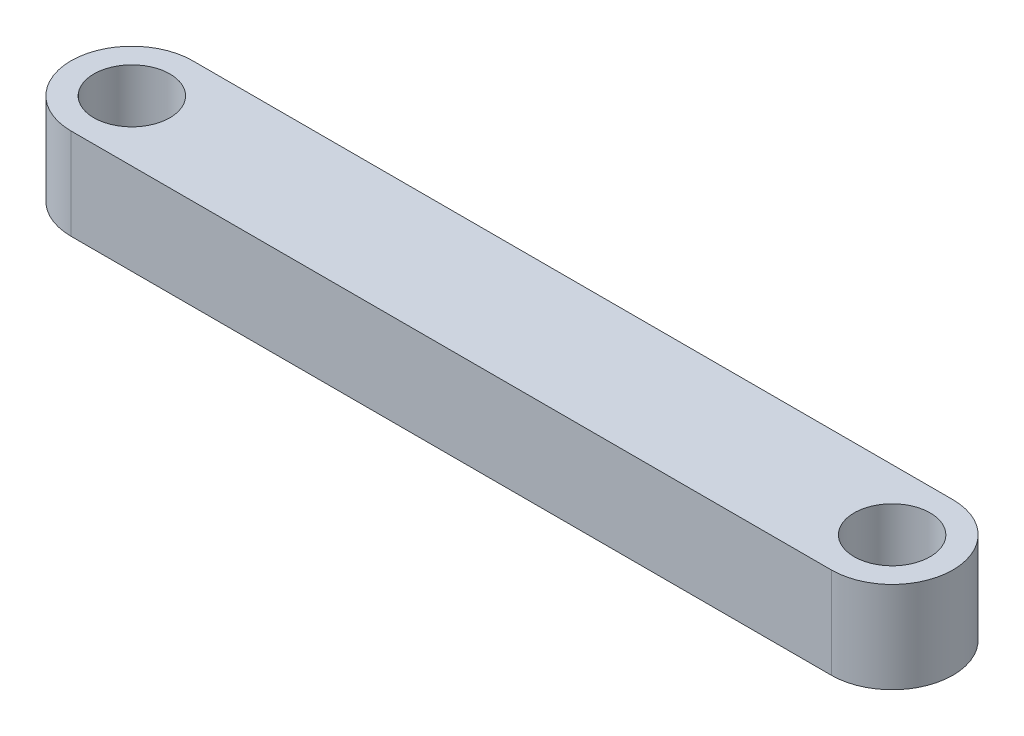
ISO-10303-21;
HEADER;
FILE_DESCRIPTION(('STEP AP214'),'2;1');
FILE_NAME('part.step','',(''),(''),'','','');
FILE_SCHEMA(('AUTOMOTIVE_DESIGN { 1 0 10303 214 1 1 1 1 }'));
ENDSEC;
DATA;
#1=APPLICATION_CONTEXT('core data for automotive mechanical design processes');
#2=APPLICATION_PROTOCOL_DEFINITION('international standard','automotive_design',2000,#1);
#3=PRODUCT_CONTEXT('',#1,'mechanical');
#4=PRODUCT('Part','Part','',(#3));
#5=PRODUCT_RELATED_PRODUCT_CATEGORY('part','',(#4));
#6=PRODUCT_DEFINITION_FORMATION('','',#4);
#7=PRODUCT_DEFINITION_CONTEXT('part definition',#1,'design');
#8=PRODUCT_DEFINITION('design','',#6,#7);
#9=PRODUCT_DEFINITION_SHAPE('','',#8);
#10=(LENGTH_UNIT() NAMED_UNIT(*) SI_UNIT(.MILLI.,.METRE.));
#11=(NAMED_UNIT(*) PLANE_ANGLE_UNIT() SI_UNIT($,.RADIAN.));
#12=(NAMED_UNIT(*) SI_UNIT($,.STERADIAN.) SOLID_ANGLE_UNIT());
#13=UNCERTAINTY_MEASURE_WITH_UNIT(LENGTH_MEASURE(1.E-05),#10,'distance_accuracy_value','');
#14=(GEOMETRIC_REPRESENTATION_CONTEXT(3) GLOBAL_UNCERTAINTY_ASSIGNED_CONTEXT((#13)) GLOBAL_UNIT_ASSIGNED_CONTEXT((#10,
#11,#12)) REPRESENTATION_CONTEXT('',''));
#15=CARTESIAN_POINT('',(0.,0.,0.));
#16=DIRECTION('',(0.,0.,1.));
#17=DIRECTION('',(1.,0.,0.));
#18=AXIS2_PLACEMENT_3D('',#15,#16,#17);
#19=CARTESIAN_POINT('',(0.,7.62,0.));
#20=DIRECTION('',(0.,1.,0.));
#21=DIRECTION('',(0.,0.,1.));
#22=AXIS2_PLACEMENT_3D('',#19,#20,#21);
#23=PLANE('',#22);
#24=CARTESIAN_POINT('',(0.,7.62,0.));
#25=DIRECTION('',(0.,1.,0.));
#26=DIRECTION('',(0.,0.,1.));
#27=AXIS2_PLACEMENT_3D('',#24,#25,#26);
#28=CIRCLE('',#27,3.175);
#29=CARTESIAN_POINT('',(0.,7.62,3.175));
#30=VERTEX_POINT('',#29);
#31=EDGE_CURVE('E99',#30,#30,#28,.T.);
#32=ORIENTED_EDGE('',*,*,#31,.F.);
#33=EDGE_LOOP('',(#32));
#34=FACE_BOUND('',#33,.T.);
#35=CARTESIAN_POINT('',(0.,7.62,0.));
#36=DIRECTION('',(0.,1.,0.));
#37=DIRECTION('',(0.,0.,1.));
#38=AXIS2_PLACEMENT_3D('',#35,#36,#37);
#39=CIRCLE('',#38,5.08);
#40=CARTESIAN_POINT('',(0.,7.62,-5.08));
#41=VERTEX_POINT('',#40);
#42=CARTESIAN_POINT('',(0.,7.62,5.08));
#43=VERTEX_POINT('',#42);
#44=EDGE_CURVE('E84',#41,#43,#39,.T.);
#45=ORIENTED_EDGE('',*,*,#44,.T.);
#46=DIRECTION('',(1.,0.,0.));
#47=VECTOR('',#46,1.);
#48=CARTESIAN_POINT('',(0.,7.62,5.08));
#49=LINE('',#48,#47);
#50=CARTESIAN_POINT('',(63.5,7.62,5.08));
#51=VERTEX_POINT('',#50);
#52=EDGE_CURVE('E79',#43,#51,#49,.T.);
#53=ORIENTED_EDGE('',*,*,#52,.T.);
#54=CARTESIAN_POINT('',(63.5,7.62,0.));
#55=DIRECTION('',(0.,1.,0.));
#56=DIRECTION('',(0.,0.,1.));
#57=AXIS2_PLACEMENT_3D('',#54,#55,#56);
#58=CIRCLE('',#57,5.08);
#59=CARTESIAN_POINT('',(63.5,7.62,-5.08));
#60=VERTEX_POINT('',#59);
#61=EDGE_CURVE('E82',#51,#60,#58,.T.);
#62=ORIENTED_EDGE('',*,*,#61,.T.);
#63=DIRECTION('',(-1.,0.,0.));
#64=VECTOR('',#63,1.);
#65=CARTESIAN_POINT('',(0.,7.62,-5.08));
#66=LINE('',#65,#64);
#67=EDGE_CURVE('E49',#60,#41,#66,.T.);
#68=ORIENTED_EDGE('',*,*,#67,.T.);
#69=EDGE_LOOP('',(#45,#53,#62,#68));
#70=FACE_BOUND('',#69,.T.);
#71=CARTESIAN_POINT('',(63.5,7.62,0.));
#72=DIRECTION('',(0.,1.,0.));
#73=DIRECTION('',(0.,0.,1.));
#74=AXIS2_PLACEMENT_3D('',#71,#72,#73);
#75=CIRCLE('',#74,3.175);
#76=CARTESIAN_POINT('',(63.5,7.62,3.175));
#77=VERTEX_POINT('',#76);
#78=EDGE_CURVE('E114',#77,#77,#75,.T.);
#79=ORIENTED_EDGE('',*,*,#78,.F.);
#80=EDGE_LOOP('',(#79));
#81=FACE_BOUND('',#80,.T.);
#82=ADVANCED_FACE('F32',(#34,#70,#81),#23,.T.);
#83=CARTESIAN_POINT('',(0.,0.,0.));
#84=DIRECTION('',(0.,1.,0.));
#85=DIRECTION('',(0.,0.,1.));
#86=AXIS2_PLACEMENT_3D('',#83,#84,#85);
#87=PLANE('',#86);
#88=CARTESIAN_POINT('',(0.,0.,0.));
#89=DIRECTION('',(0.,1.,0.));
#90=DIRECTION('',(0.,0.,1.));
#91=AXIS2_PLACEMENT_3D('',#88,#89,#90);
#92=CIRCLE('',#91,3.175);
#93=CARTESIAN_POINT('',(0.,0.,3.175));
#94=VERTEX_POINT('',#93);
#95=EDGE_CURVE('E111',#94,#94,#92,.T.);
#96=ORIENTED_EDGE('',*,*,#95,.T.);
#97=EDGE_LOOP('',(#96));
#98=FACE_BOUND('',#97,.T.);
#99=CARTESIAN_POINT('',(0.,0.,0.));
#100=DIRECTION('',(0.,1.,0.));
#101=DIRECTION('',(0.,0.,1.));
#102=AXIS2_PLACEMENT_3D('',#99,#100,#101);
#103=CIRCLE('',#102,5.08);
#104=CARTESIAN_POINT('',(0.,0.,-5.08));
#105=VERTEX_POINT('',#104);
#106=CARTESIAN_POINT('',(0.,0.,5.08));
#107=VERTEX_POINT('',#106);
#108=EDGE_CURVE('E96',#105,#107,#103,.T.);
#109=ORIENTED_EDGE('',*,*,#108,.F.);
#110=DIRECTION('',(-1.,0.,0.));
#111=VECTOR('',#110,1.);
#112=CARTESIAN_POINT('',(0.,0.,-5.08));
#113=LINE('',#112,#111);
#114=CARTESIAN_POINT('',(63.5,0.,-5.08));
#115=VERTEX_POINT('',#114);
#116=EDGE_CURVE('E72',#115,#105,#113,.T.);
#117=ORIENTED_EDGE('',*,*,#116,.F.);
#118=CARTESIAN_POINT('',(63.5,0.,0.));
#119=DIRECTION('',(0.,1.,0.));
#120=DIRECTION('',(0.,0.,1.));
#121=AXIS2_PLACEMENT_3D('',#118,#119,#120);
#122=CIRCLE('',#121,5.08);
#123=CARTESIAN_POINT('',(63.5,0.,5.08));
#124=VERTEX_POINT('',#123);
#125=EDGE_CURVE('E66',#124,#115,#122,.T.);
#126=ORIENTED_EDGE('',*,*,#125,.F.);
#127=DIRECTION('',(1.,0.,0.));
#128=VECTOR('',#127,1.);
#129=CARTESIAN_POINT('',(0.,0.,5.08));
#130=LINE('',#129,#128);
#131=EDGE_CURVE('E88',#107,#124,#130,.T.);
#132=ORIENTED_EDGE('',*,*,#131,.F.);
#133=EDGE_LOOP('',(#109,#117,#126,#132));
#134=FACE_BOUND('',#133,.T.);
#135=CARTESIAN_POINT('',(63.5,0.,0.));
#136=DIRECTION('',(0.,1.,0.));
#137=DIRECTION('',(0.,0.,1.));
#138=AXIS2_PLACEMENT_3D('',#135,#136,#137);
#139=CIRCLE('',#138,3.175);
#140=CARTESIAN_POINT('',(63.5,0.,3.175));
#141=VERTEX_POINT('',#140);
#142=EDGE_CURVE('E117',#141,#141,#139,.T.);
#143=ORIENTED_EDGE('',*,*,#142,.T.);
#144=EDGE_LOOP('',(#143));
#145=FACE_BOUND('',#144,.T.);
#146=ADVANCED_FACE('F107',(#98,#134,#145),#87,.F.);
#147=CARTESIAN_POINT('',(0.,7.62,0.));
#148=DIRECTION('',(0.,-1.,0.));
#149=DIRECTION('',(0.,0.,-1.));
#150=AXIS2_PLACEMENT_3D('',#147,#148,#149);
#151=CYLINDRICAL_SURFACE('',#150,5.08);
#152=ORIENTED_EDGE('',*,*,#108,.T.);
#153=DIRECTION('',(0.,-1.,0.));
#154=VECTOR('',#153,1.);
#155=CARTESIAN_POINT('',(0.,7.62,5.08));
#156=LINE('',#155,#154);
#157=EDGE_CURVE('E11',#43,#107,#156,.T.);
#158=ORIENTED_EDGE('',*,*,#157,.F.);
#159=ORIENTED_EDGE('',*,*,#44,.F.);
#160=DIRECTION('',(0.,-1.,0.));
#161=VECTOR('',#160,1.);
#162=CARTESIAN_POINT('',(0.,7.62,-5.08));
#163=LINE('',#162,#161);
#164=EDGE_CURVE('E92',#41,#105,#163,.T.);
#165=ORIENTED_EDGE('',*,*,#164,.T.);
#166=EDGE_LOOP('',(#152,#158,#159,#165));
#167=FACE_BOUND('',#166,.T.);
#168=ADVANCED_FACE('F34',(#167),#151,.T.);
#169=CARTESIAN_POINT('',(0.,7.62,5.08));
#170=DIRECTION('',(0.,0.,-1.));
#171=DIRECTION('',(-1.,0.,0.));
#172=AXIS2_PLACEMENT_3D('',#169,#170,#171);
#173=PLANE('',#172);
#174=ORIENTED_EDGE('',*,*,#131,.T.);
#175=DIRECTION('',(0.,-1.,0.));
#176=VECTOR('',#175,1.);
#177=CARTESIAN_POINT('',(63.5,7.62,5.08));
#178=LINE('',#177,#176);
#179=EDGE_CURVE('E41',#51,#124,#178,.T.);
#180=ORIENTED_EDGE('',*,*,#179,.F.);
#181=ORIENTED_EDGE('',*,*,#52,.F.);
#182=ORIENTED_EDGE('',*,*,#157,.T.);
#183=EDGE_LOOP('',(#174,#180,#181,#182));
#184=FACE_BOUND('',#183,.T.);
#185=ADVANCED_FACE('F87',(#184),#173,.F.);
#186=CARTESIAN_POINT('',(63.5,7.62,0.));
#187=DIRECTION('',(0.,-1.,0.));
#188=DIRECTION('',(0.,0.,-1.));
#189=AXIS2_PLACEMENT_3D('',#186,#187,#188);
#190=CYLINDRICAL_SURFACE('',#189,5.08);
#191=ORIENTED_EDGE('',*,*,#125,.T.);
#192=DIRECTION('',(0.,-1.,0.));
#193=VECTOR('',#192,1.);
#194=CARTESIAN_POINT('',(63.5,7.62,-5.08));
#195=LINE('',#194,#193);
#196=EDGE_CURVE('E89',#60,#115,#195,.T.);
#197=ORIENTED_EDGE('',*,*,#196,.F.);
#198=ORIENTED_EDGE('',*,*,#61,.F.);
#199=ORIENTED_EDGE('',*,*,#179,.T.);
#200=EDGE_LOOP('',(#191,#197,#198,#199));
#201=FACE_BOUND('',#200,.T.);
#202=ADVANCED_FACE('F90',(#201),#190,.T.);
#203=CARTESIAN_POINT('',(0.,7.62,-5.08));
#204=DIRECTION('',(0.,0.,1.));
#205=DIRECTION('',(1.,0.,0.));
#206=AXIS2_PLACEMENT_3D('',#203,#204,#205);
#207=PLANE('',#206);
#208=ORIENTED_EDGE('',*,*,#116,.T.);
#209=ORIENTED_EDGE('',*,*,#164,.F.);
#210=ORIENTED_EDGE('',*,*,#67,.F.);
#211=ORIENTED_EDGE('',*,*,#196,.T.);
#212=EDGE_LOOP('',(#208,#209,#210,#211));
#213=FACE_BOUND('',#212,.T.);
#214=ADVANCED_FACE('F104',(#213),#207,.F.);
#215=CARTESIAN_POINT('',(0.,7.62,0.));
#216=DIRECTION('',(0.,-1.,0.));
#217=DIRECTION('',(0.,0.,-1.));
#218=AXIS2_PLACEMENT_3D('',#215,#216,#217);
#219=CYLINDRICAL_SURFACE('',#218,3.175);
#220=ORIENTED_EDGE('',*,*,#31,.T.);
#221=EDGE_LOOP('',(#220));
#222=FACE_BOUND('',#221,.T.);
#223=ORIENTED_EDGE('',*,*,#95,.F.);
#224=EDGE_LOOP('',(#223));
#225=FACE_BOUND('',#224,.T.);
#226=ADVANCED_FACE('F135',(#222,#225),#219,.F.);
#227=CARTESIAN_POINT('',(63.5,7.62,0.));
#228=DIRECTION('',(0.,-1.,0.));
#229=DIRECTION('',(0.,0.,-1.));
#230=AXIS2_PLACEMENT_3D('',#227,#228,#229);
#231=CYLINDRICAL_SURFACE('',#230,3.175);
#232=ORIENTED_EDGE('',*,*,#78,.T.);
#233=EDGE_LOOP('',(#232));
#234=FACE_BOUND('',#233,.T.);
#235=ORIENTED_EDGE('',*,*,#142,.F.);
#236=EDGE_LOOP('',(#235));
#237=FACE_BOUND('',#236,.T.);
#238=ADVANCED_FACE('F123',(#234,#237),#231,.F.);
#239=CLOSED_SHELL('',(#82,#146,#168,#185,#202,#214,#226,#238));
#240=MANIFOLD_SOLID_BREP('B2',#239);
#241=ADVANCED_BREP_SHAPE_REPRESENTATION('',(#18,#240),#14);
#242=SHAPE_DEFINITION_REPRESENTATION(#9,#241);
ENDSEC;
END-ISO-10303-21;
